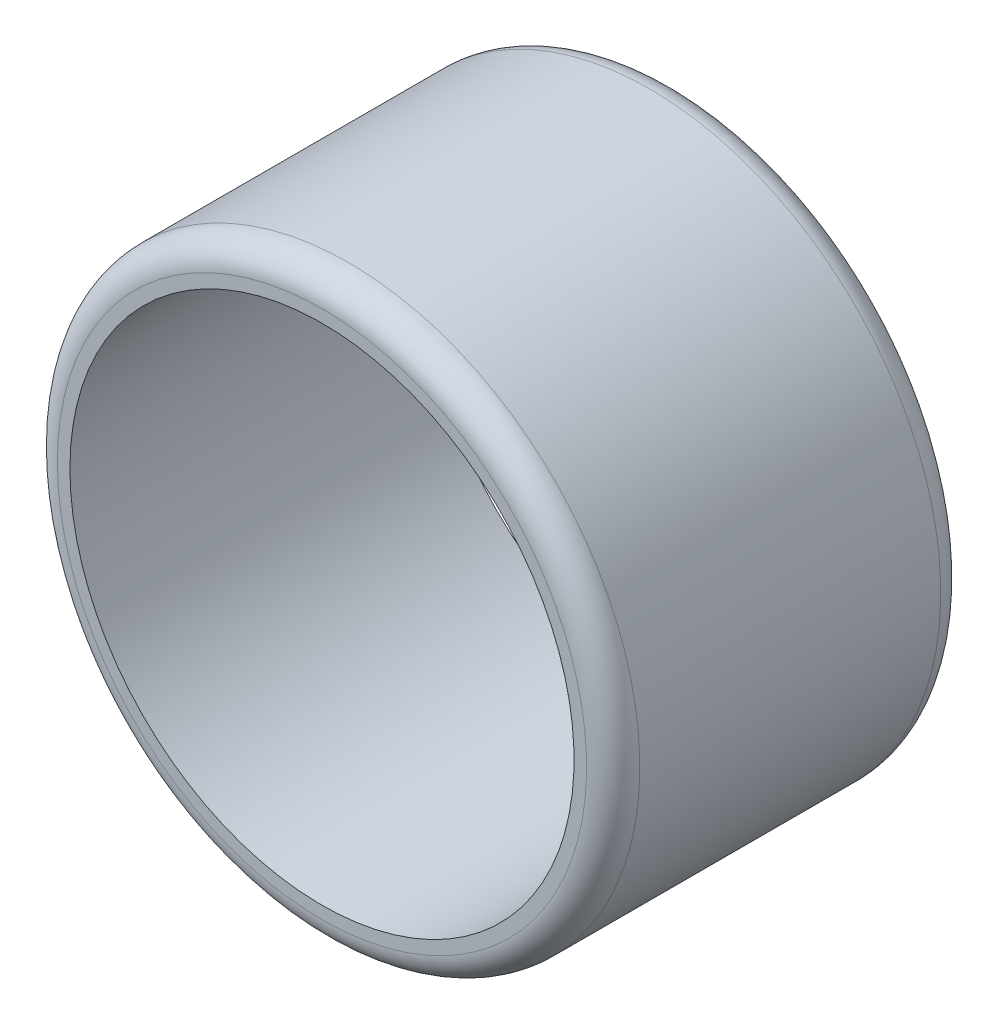
ISO-10303-21;
HEADER;
FILE_DESCRIPTION(('STEP AP214'),'2;1');
FILE_NAME('part.step','',(''),(''),'','','');
FILE_SCHEMA(('AUTOMOTIVE_DESIGN { 1 0 10303 214 1 1 1 1 }'));
ENDSEC;
DATA;
#1=APPLICATION_CONTEXT('core data for automotive mechanical design processes');
#2=APPLICATION_PROTOCOL_DEFINITION('international standard','automotive_design',2000,#1);
#3=PRODUCT_CONTEXT('',#1,'mechanical');
#4=PRODUCT('Part','Part','',(#3));
#5=PRODUCT_RELATED_PRODUCT_CATEGORY('part','',(#4));
#6=PRODUCT_DEFINITION_FORMATION('','',#4);
#7=PRODUCT_DEFINITION_CONTEXT('part definition',#1,'design');
#8=PRODUCT_DEFINITION('design','',#6,#7);
#9=PRODUCT_DEFINITION_SHAPE('','',#8);
#10=(LENGTH_UNIT() NAMED_UNIT(*) SI_UNIT(.MILLI.,.METRE.));
#11=(NAMED_UNIT(*) PLANE_ANGLE_UNIT() SI_UNIT($,.RADIAN.));
#12=(NAMED_UNIT(*) SI_UNIT($,.STERADIAN.) SOLID_ANGLE_UNIT());
#13=UNCERTAINTY_MEASURE_WITH_UNIT(LENGTH_MEASURE(1.E-05),#10,'distance_accuracy_value','');
#14=(GEOMETRIC_REPRESENTATION_CONTEXT(3) GLOBAL_UNCERTAINTY_ASSIGNED_CONTEXT((#13)) GLOBAL_UNIT_ASSIGNED_CONTEXT((#10,
#11,#12)) REPRESENTATION_CONTEXT('',''));
#15=CARTESIAN_POINT('',(0.,0.,0.));
#16=DIRECTION('',(0.,0.,1.));
#17=DIRECTION('',(1.,0.,0.));
#18=AXIS2_PLACEMENT_3D('',#15,#16,#17);
#19=CARTESIAN_POINT('',(-7927.40763591954,2848.66816357867,-167.815188950199));
#20=DIRECTION('',(0.,0.,1.));
#21=DIRECTION('',(0.,-1.,0.));
#22=AXIS2_PLACEMENT_3D('',#19,#20,#21);
#23=CYLINDRICAL_SURFACE('',#22,1094.33226867246);
#24=CARTESIAN_POINT('',(-7927.40763591954,2848.66816357867,1063.1848110498));
#25=DIRECTION('',(0.,0.,-1.));
#26=DIRECTION('',(-1.,0.,0.));
#27=AXIS2_PLACEMENT_3D('',#24,#25,#26);
#28=CIRCLE('',#27,1094.33226867246);
#29=CARTESIAN_POINT('',(-9021.739904592,2848.66816357867,1063.1848110498));
#30=VERTEX_POINT('',#29);
#31=EDGE_CURVE('E24',#30,#30,#28,.F.);
#32=ORIENTED_EDGE('',*,*,#31,.F.);
#33=EDGE_LOOP('',(#32));
#34=FACE_BOUND('',#33,.T.);
#35=CARTESIAN_POINT('',(-7927.40763591954,2848.66816357867,-67.815188950199));
#36=DIRECTION('',(0.,0.,-1.));
#37=DIRECTION('',(-1.,0.,0.));
#38=AXIS2_PLACEMENT_3D('',#35,#36,#37);
#39=CIRCLE('',#38,1094.33226867246);
#40=CARTESIAN_POINT('',(-9021.739904592,2848.66816357867,-67.815188950199));
#41=VERTEX_POINT('',#40);
#42=EDGE_CURVE('E28',#41,#41,#39,.T.);
#43=ORIENTED_EDGE('',*,*,#42,.F.);
#44=EDGE_LOOP('',(#43));
#45=FACE_BOUND('',#44,.T.);
#46=ADVANCED_FACE('F14',(#34,#45),#23,.T.);
#47=CARTESIAN_POINT('',(-7927.40763591954,2848.66816357867,-167.815188950199));
#48=DIRECTION('',(0.,0.,1.));
#49=DIRECTION('',(0.,-1.,0.));
#50=AXIS2_PLACEMENT_3D('',#47,#48,#49);
#51=PLANE('',#50);
#52=CARTESIAN_POINT('',(-7927.40763591954,2848.66816357867,-167.815188950199));
#53=DIRECTION('',(0.,0.,-1.));
#54=DIRECTION('',(-1.,0.,0.));
#55=AXIS2_PLACEMENT_3D('',#52,#53,#54);
#56=CIRCLE('',#55,994.33226867246);
#57=CARTESIAN_POINT('',(-8921.739904592,2848.66816357867,-167.815188950199));
#58=VERTEX_POINT('',#57);
#59=EDGE_CURVE('E9',#58,#58,#56,.F.);
#60=ORIENTED_EDGE('',*,*,#59,.F.);
#61=EDGE_LOOP('',(#60));
#62=FACE_BOUND('',#61,.T.);
#63=CARTESIAN_POINT('',(-7927.40763591954,2848.66816357867,-167.815188950199));
#64=DIRECTION('',(0.,0.,-1.));
#65=DIRECTION('',(-1.,0.,0.));
#66=AXIS2_PLACEMENT_3D('',#63,#64,#65);
#67=CIRCLE('',#66,947.263104027568);
#68=CARTESIAN_POINT('',(-8874.67073994711,2848.66816357867,-167.815188950199));
#69=VERTEX_POINT('',#68);
#70=EDGE_CURVE('E33',#69,#69,#67,.T.);
#71=ORIENTED_EDGE('',*,*,#70,.F.);
#72=EDGE_LOOP('',(#71));
#73=FACE_BOUND('',#72,.T.);
#74=ADVANCED_FACE('F42',(#62,#73),#51,.F.);
#75=CARTESIAN_POINT('',(-7927.40763591954,2848.66816357867,1163.1848110498));
#76=DIRECTION('',(0.,0.,1.));
#77=DIRECTION('',(0.,-1.,0.));
#78=AXIS2_PLACEMENT_3D('',#75,#76,#77);
#79=PLANE('',#78);
#80=CARTESIAN_POINT('',(-7927.40763591954,2848.66816357867,1163.1848110498));
#81=DIRECTION('',(0.,0.,-1.));
#82=DIRECTION('',(-1.,0.,0.));
#83=AXIS2_PLACEMENT_3D('',#80,#81,#82);
#84=CIRCLE('',#83,994.33226867246);
#85=CARTESIAN_POINT('',(-8921.739904592,2848.66816357867,1163.1848110498));
#86=VERTEX_POINT('',#85);
#87=EDGE_CURVE('E20',#86,#86,#84,.T.);
#88=ORIENTED_EDGE('',*,*,#87,.F.);
#89=EDGE_LOOP('',(#88));
#90=FACE_BOUND('',#89,.T.);
#91=CARTESIAN_POINT('',(-7927.40763591954,2848.66816357867,1163.1848110498));
#92=DIRECTION('',(0.,0.,-1.));
#93=DIRECTION('',(-1.,0.,0.));
#94=AXIS2_PLACEMENT_3D('',#91,#92,#93);
#95=CIRCLE('',#94,947.263104027568);
#96=CARTESIAN_POINT('',(-8874.67073994711,2848.66816357867,1163.1848110498));
#97=VERTEX_POINT('',#96);
#98=EDGE_CURVE('E34',#97,#97,#95,.T.);
#99=ORIENTED_EDGE('',*,*,#98,.T.);
#100=EDGE_LOOP('',(#99));
#101=FACE_BOUND('',#100,.T.);
#102=ADVANCED_FACE('F44',(#90,#101),#79,.T.);
#103=CARTESIAN_POINT('',(-7927.40763591954,2848.66816357867,-409.815188950199));
#104=DIRECTION('',(0.,0.,1.));
#105=DIRECTION('',(-1.,0.,0.));
#106=AXIS2_PLACEMENT_3D('',#103,#104,#105);
#107=CYLINDRICAL_SURFACE('',#106,947.263104027568);
#108=ORIENTED_EDGE('',*,*,#98,.F.);
#109=EDGE_LOOP('',(#108));
#110=FACE_BOUND('',#109,.T.);
#111=ORIENTED_EDGE('',*,*,#70,.T.);
#112=EDGE_LOOP('',(#111));
#113=FACE_BOUND('',#112,.T.);
#114=ADVANCED_FACE('F40',(#110,#113),#107,.F.);
#115=CARTESIAN_POINT('',(-7927.40763591954,2848.66816357867,1063.1848110498));
#116=DIRECTION('',(0.,0.,1.));
#117=DIRECTION('',(-1.,0.,0.));
#118=AXIS2_PLACEMENT_3D('',#115,#116,#117);
#119=TOROIDAL_SURFACE('',#118,994.33226867246,100.);
#120=ORIENTED_EDGE('',*,*,#87,.T.);
#121=EDGE_LOOP('',(#120));
#122=FACE_BOUND('',#121,.T.);
#123=ORIENTED_EDGE('',*,*,#31,.T.);
#124=EDGE_LOOP('',(#123));
#125=FACE_BOUND('',#124,.T.);
#126=ADVANCED_FACE('F57',(#122,#125),#119,.T.);
#127=CARTESIAN_POINT('',(-7927.40763591954,2848.66816357867,-67.815188950199));
#128=DIRECTION('',(0.,0.,1.));
#129=DIRECTION('',(-1.,0.,0.));
#130=AXIS2_PLACEMENT_3D('',#127,#128,#129);
#131=TOROIDAL_SURFACE('',#130,994.33226867246,100.);
#132=ORIENTED_EDGE('',*,*,#42,.T.);
#133=EDGE_LOOP('',(#132));
#134=FACE_BOUND('',#133,.T.);
#135=ORIENTED_EDGE('',*,*,#59,.T.);
#136=EDGE_LOOP('',(#135));
#137=FACE_BOUND('',#136,.T.);
#138=ADVANCED_FACE('F61',(#134,#137),#131,.T.);
#139=CLOSED_SHELL('',(#46,#74,#102,#114,#126,#138));
#140=MANIFOLD_SOLID_BREP('B1',#139);
#141=ADVANCED_BREP_SHAPE_REPRESENTATION('',(#18,#140),#14);
#142=SHAPE_DEFINITION_REPRESENTATION(#9,#141);
ENDSEC;
END-ISO-10303-21;
